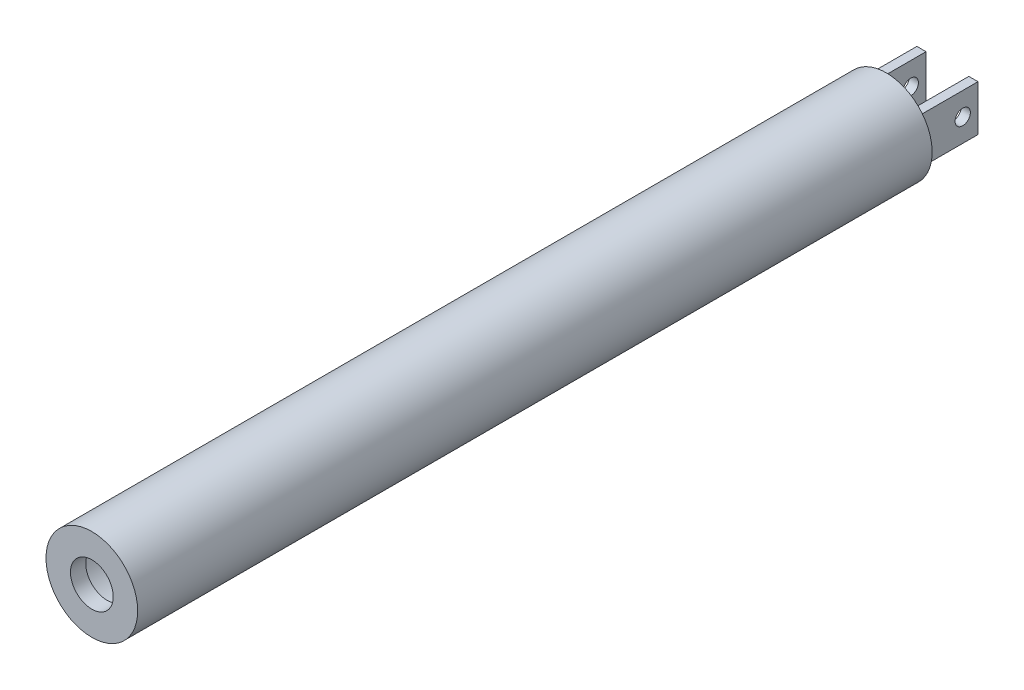
ISO-10303-21;
HEADER;
FILE_DESCRIPTION(('STEP AP214'),'2;1');
FILE_NAME('part.step','',(''),(''),'','','');
FILE_SCHEMA(('AUTOMOTIVE_DESIGN { 1 0 10303 214 1 1 1 1 }'));
ENDSEC;
DATA;
#1=APPLICATION_CONTEXT('core data for automotive mechanical design processes');
#2=APPLICATION_PROTOCOL_DEFINITION('international standard','automotive_design',2000,#1);
#3=PRODUCT_CONTEXT('',#1,'mechanical');
#4=PRODUCT('Part','Part','',(#3));
#5=PRODUCT_RELATED_PRODUCT_CATEGORY('part','',(#4));
#6=PRODUCT_DEFINITION_FORMATION('','',#4);
#7=PRODUCT_DEFINITION_CONTEXT('part definition',#1,'design');
#8=PRODUCT_DEFINITION('design','',#6,#7);
#9=PRODUCT_DEFINITION_SHAPE('','',#8);
#10=(LENGTH_UNIT() NAMED_UNIT(*) SI_UNIT(.MILLI.,.METRE.));
#11=(NAMED_UNIT(*) PLANE_ANGLE_UNIT() SI_UNIT($,.RADIAN.));
#12=(NAMED_UNIT(*) SI_UNIT($,.STERADIAN.) SOLID_ANGLE_UNIT());
#13=UNCERTAINTY_MEASURE_WITH_UNIT(LENGTH_MEASURE(1.E-05),#10,'distance_accuracy_value','');
#14=(GEOMETRIC_REPRESENTATION_CONTEXT(3) GLOBAL_UNCERTAINTY_ASSIGNED_CONTEXT((#13)) GLOBAL_UNIT_ASSIGNED_CONTEXT((#10,
#11,#12)) REPRESENTATION_CONTEXT('',''));
#15=CARTESIAN_POINT('',(0.,0.,0.));
#16=DIRECTION('',(0.,0.,1.));
#17=DIRECTION('',(1.,0.,0.));
#18=AXIS2_PLACEMENT_3D('',#15,#16,#17);
#19=CARTESIAN_POINT('',(-10.,-7.50000000000001,-25.));
#20=DIRECTION('',(0.,0.,-1.));
#21=DIRECTION('',(-1.,0.,0.));
#22=AXIS2_PLACEMENT_3D('',#19,#20,#21);
#23=PLANE('',#22);
#24=DIRECTION('',(0.,1.,0.));
#25=VECTOR('',#24,1.);
#26=CARTESIAN_POINT('',(-7.,-7.49999999999998,-25.));
#27=LINE('',#26,#25);
#28=CARTESIAN_POINT('',(-7.,-7.49999999999998,-25.));
#29=VERTEX_POINT('',#28);
#30=CARTESIAN_POINT('',(-7.,7.49999999999998,-25.));
#31=VERTEX_POINT('',#30);
#32=EDGE_CURVE('E99',#29,#31,#27,.T.);
#33=ORIENTED_EDGE('',*,*,#32,.F.);
#34=DIRECTION('',(1.,0.,0.));
#35=VECTOR('',#34,1.);
#36=CARTESIAN_POINT('',(-10.,-7.50000000000001,-25.));
#37=LINE('',#36,#35);
#38=CARTESIAN_POINT('',(-10.,-7.50000000000001,-25.));
#39=VERTEX_POINT('',#38);
#40=EDGE_CURVE('E134',#39,#29,#37,.T.);
#41=ORIENTED_EDGE('',*,*,#40,.F.);
#42=DIRECTION('',(0.,1.,0.));
#43=VECTOR('',#42,1.);
#44=CARTESIAN_POINT('',(-10.,-7.50000000000001,-25.));
#45=LINE('',#44,#43);
#46=CARTESIAN_POINT('',(-10.,7.49999999999999,-25.));
#47=VERTEX_POINT('',#46);
#48=EDGE_CURVE('E120',#39,#47,#45,.T.);
#49=ORIENTED_EDGE('',*,*,#48,.T.);
#50=DIRECTION('',(1.,0.,0.));
#51=VECTOR('',#50,1.);
#52=CARTESIAN_POINT('',(-10.,7.49999999999999,-25.));
#53=LINE('',#52,#51);
#54=EDGE_CURVE('E113',#47,#31,#53,.T.);
#55=ORIENTED_EDGE('',*,*,#54,.T.);
#56=EDGE_LOOP('',(#33,#41,#49,#55));
#57=FACE_BOUND('',#56,.T.);
#58=ADVANCED_FACE('F33',(#57),#23,.T.);
#59=CARTESIAN_POINT('',(-10.,-7.50000000000001,-25.));
#60=DIRECTION('',(0.,-1.,0.));
#61=DIRECTION('',(0.,0.,-1.));
#62=AXIS2_PLACEMENT_3D('',#59,#60,#61);
#63=PLANE('',#62);
#64=DIRECTION('',(0.,0.,-1.));
#65=VECTOR('',#64,1.);
#66=CARTESIAN_POINT('',(-7.,-7.49999999999998,15.5182845286832));
#67=LINE('',#66,#65);
#68=CARTESIAN_POINT('',(-7.,-7.49999999999998,-5.));
#69=VERTEX_POINT('',#68);
#70=EDGE_CURVE('E103',#69,#29,#67,.T.);
#71=ORIENTED_EDGE('',*,*,#70,.F.);
#72=DIRECTION('',(1.,0.,0.));
#73=VECTOR('',#72,1.);
#74=CARTESIAN_POINT('',(-10.,-7.50000000000001,-5.));
#75=LINE('',#74,#73);
#76=CARTESIAN_POINT('',(-10.,-7.50000000000001,-5.));
#77=VERTEX_POINT('',#76);
#78=EDGE_CURVE('E183',#77,#69,#75,.T.);
#79=ORIENTED_EDGE('',*,*,#78,.F.);
#80=DIRECTION('',(0.,0.,-1.));
#81=VECTOR('',#80,1.);
#82=CARTESIAN_POINT('',(-10.,-7.50000000000001,-25.));
#83=LINE('',#82,#81);
#84=EDGE_CURVE('E58',#77,#39,#83,.T.);
#85=ORIENTED_EDGE('',*,*,#84,.T.);
#86=ORIENTED_EDGE('',*,*,#40,.T.);
#87=EDGE_LOOP('',(#71,#79,#85,#86));
#88=FACE_BOUND('',#87,.T.);
#89=ADVANCED_FACE('F220',(#88),#63,.T.);
#90=CARTESIAN_POINT('',(-10.,7.49999999999999,-25.));
#91=DIRECTION('',(0.,1.,0.));
#92=DIRECTION('',(0.,0.,1.));
#93=AXIS2_PLACEMENT_3D('',#90,#91,#92);
#94=PLANE('',#93);
#95=DIRECTION('',(0.,0.,-1.));
#96=VECTOR('',#95,1.);
#97=CARTESIAN_POINT('',(-7.,7.49999999999998,15.5182845286832));
#98=LINE('',#97,#96);
#99=CARTESIAN_POINT('',(-7.,7.49999999999999,-5.));
#100=VERTEX_POINT('',#99);
#101=EDGE_CURVE('E50',#100,#31,#98,.T.);
#102=ORIENTED_EDGE('',*,*,#101,.T.);
#103=ORIENTED_EDGE('',*,*,#54,.F.);
#104=DIRECTION('',(0.,0.,1.));
#105=VECTOR('',#104,1.);
#106=CARTESIAN_POINT('',(-10.,7.49999999999999,-25.));
#107=LINE('',#106,#105);
#108=CARTESIAN_POINT('',(-10.,7.49999999999999,-5.));
#109=VERTEX_POINT('',#108);
#110=EDGE_CURVE('E176',#47,#109,#107,.T.);
#111=ORIENTED_EDGE('',*,*,#110,.T.);
#112=DIRECTION('',(1.,0.,0.));
#113=VECTOR('',#112,1.);
#114=CARTESIAN_POINT('',(-10.,7.49999999999999,-5.));
#115=LINE('',#114,#113);
#116=EDGE_CURVE('E116',#109,#100,#115,.T.);
#117=ORIENTED_EDGE('',*,*,#116,.T.);
#118=EDGE_LOOP('',(#102,#103,#111,#117));
#119=FACE_BOUND('',#118,.T.);
#120=ADVANCED_FACE('F111',(#119),#94,.T.);
#121=CARTESIAN_POINT('',(-10.,0.,-20.));
#122=DIRECTION('',(1.,0.,0.));
#123=DIRECTION('',(0.,0.,-1.));
#124=AXIS2_PLACEMENT_3D('',#121,#122,#123);
#125=CYLINDRICAL_SURFACE('',#124,2.5);
#126=CARTESIAN_POINT('',(-7.,0.,-20.));
#127=DIRECTION('',(-1.,0.,0.));
#128=DIRECTION('',(0.,0.,1.));
#129=AXIS2_PLACEMENT_3D('',#126,#127,#128);
#130=CIRCLE('',#129,2.5);
#131=CARTESIAN_POINT('',(-7.,0.,-17.5));
#132=VERTEX_POINT('',#131);
#133=EDGE_CURVE('E37',#132,#132,#130,.F.);
#134=ORIENTED_EDGE('',*,*,#133,.T.);
#135=EDGE_LOOP('',(#134));
#136=FACE_BOUND('',#135,.T.);
#137=CARTESIAN_POINT('',(-10.,0.,-20.));
#138=DIRECTION('',(1.,0.,0.));
#139=DIRECTION('',(0.,0.,-1.));
#140=AXIS2_PLACEMENT_3D('',#137,#138,#139);
#141=CIRCLE('',#140,2.5);
#142=CARTESIAN_POINT('',(-10.,0.,-22.5));
#143=VERTEX_POINT('',#142);
#144=EDGE_CURVE('E172',#143,#143,#141,.T.);
#145=ORIENTED_EDGE('',*,*,#144,.F.);
#146=EDGE_LOOP('',(#145));
#147=FACE_BOUND('',#146,.T.);
#148=ADVANCED_FACE('F247',(#136,#147),#125,.F.);
#149=CARTESIAN_POINT('',(0.,0.,-5.));
#150=DIRECTION('',(0.,0.,-1.));
#151=DIRECTION('',(-1.,0.,0.));
#152=AXIS2_PLACEMENT_3D('',#149,#150,#151);
#153=PLANE('',#152);
#154=DIRECTION('',(0.,1.,0.));
#155=VECTOR('',#154,1.);
#156=CARTESIAN_POINT('',(7.,-7.49999999999999,-5.));
#157=LINE('',#156,#155);
#158=CARTESIAN_POINT('',(7.,-7.49999999999999,-5.));
#159=VERTEX_POINT('',#158);
#160=CARTESIAN_POINT('',(7.,7.49999999999998,-5.));
#161=VERTEX_POINT('',#160);
#162=EDGE_CURVE('E148',#159,#161,#157,.T.);
#163=ORIENTED_EDGE('',*,*,#162,.F.);
#164=CARTESIAN_POINT('',(10.,-7.50000000000001,-5.));
#165=VERTEX_POINT('',#164);
#166=EDGE_CURVE('E185',#159,#165,#75,.T.);
#167=ORIENTED_EDGE('',*,*,#166,.T.);
#168=DIRECTION('',(0.,-1.,0.));
#169=VECTOR('',#168,1.);
#170=CARTESIAN_POINT('',(10.,-7.50000000000001,-5.));
#171=LINE('',#170,#169);
#172=CARTESIAN_POINT('',(10.,7.49999999999999,-5.));
#173=VERTEX_POINT('',#172);
#174=EDGE_CURVE('E166',#173,#165,#171,.T.);
#175=ORIENTED_EDGE('',*,*,#174,.F.);
#176=EDGE_CURVE('E121',#161,#173,#115,.T.);
#177=ORIENTED_EDGE('',*,*,#176,.F.);
#178=EDGE_LOOP('',(#163,#167,#175,#177));
#179=FACE_BOUND('',#178,.T.);
#180=CARTESIAN_POINT('',(0.,0.,-5.));
#181=DIRECTION('',(0.,0.,-1.));
#182=DIRECTION('',(-1.,0.,0.));
#183=AXIS2_PLACEMENT_3D('',#180,#181,#182);
#184=CIRCLE('',#183,15.);
#185=CARTESIAN_POINT('',(-15.,0.,-5.));
#186=VERTEX_POINT('',#185);
#187=EDGE_CURVE('E42',#186,#186,#184,.T.);
#188=ORIENTED_EDGE('',*,*,#187,.T.);
#189=EDGE_LOOP('',(#188));
#190=FACE_BOUND('',#189,.T.);
#191=DIRECTION('',(0.,-1.,0.));
#192=VECTOR('',#191,1.);
#193=CARTESIAN_POINT('',(-10.,-7.50000000000001,-5.));
#194=LINE('',#193,#192);
#195=EDGE_CURVE('E178',#109,#77,#194,.T.);
#196=ORIENTED_EDGE('',*,*,#195,.T.);
#197=ORIENTED_EDGE('',*,*,#78,.T.);
#198=DIRECTION('',(0.,-1.,0.));
#199=VECTOR('',#198,1.);
#200=CARTESIAN_POINT('',(-7.,-7.49999999999998,-5.));
#201=LINE('',#200,#199);
#202=EDGE_CURVE('E143',#100,#69,#201,.T.);
#203=ORIENTED_EDGE('',*,*,#202,.F.);
#204=ORIENTED_EDGE('',*,*,#116,.F.);
#205=EDGE_LOOP('',(#196,#197,#203,#204));
#206=FACE_BOUND('',#205,.T.);
#207=ADVANCED_FACE('F190',(#179,#190,#206),#153,.T.);
#208=CARTESIAN_POINT('',(0.,0.,250.));
#209=DIRECTION('',(0.,0.,-1.));
#210=DIRECTION('',(-1.,0.,0.));
#211=AXIS2_PLACEMENT_3D('',#208,#209,#210);
#212=CYLINDRICAL_SURFACE('',#211,15.);
#213=ORIENTED_EDGE('',*,*,#187,.F.);
#214=EDGE_LOOP('',(#213));
#215=FACE_BOUND('',#214,.T.);
#216=CARTESIAN_POINT('',(0.,0.,255.));
#217=DIRECTION('',(0.,0.,1.));
#218=DIRECTION('',(1.,0.,0.));
#219=AXIS2_PLACEMENT_3D('',#216,#217,#218);
#220=CIRCLE('',#219,15.);
#221=CARTESIAN_POINT('',(15.,0.,255.));
#222=VERTEX_POINT('',#221);
#223=EDGE_CURVE('E130',#222,#222,#220,.T.);
#224=ORIENTED_EDGE('',*,*,#223,.F.);
#225=EDGE_LOOP('',(#224));
#226=FACE_BOUND('',#225,.T.);
#227=ADVANCED_FACE('F35',(#215,#226),#212,.T.);
#228=CARTESIAN_POINT('',(0.,0.,250.));
#229=DIRECTION('',(0.,0.,1.));
#230=DIRECTION('',(1.,0.,0.));
#231=AXIS2_PLACEMENT_3D('',#228,#229,#230);
#232=PLANE('',#231);
#233=CARTESIAN_POINT('',(0.,0.,250.));
#234=DIRECTION('',(0.,0.,1.));
#235=DIRECTION('',(1.,0.,0.));
#236=AXIS2_PLACEMENT_3D('',#233,#234,#235);
#237=CIRCLE('',#236,7.);
#238=CARTESIAN_POINT('',(7.,0.,250.));
#239=VERTEX_POINT('',#238);
#240=EDGE_CURVE('E131',#239,#239,#237,.T.);
#241=ORIENTED_EDGE('',*,*,#240,.T.);
#242=EDGE_LOOP('',(#241));
#243=FACE_BOUND('',#242,.T.);
#244=CARTESIAN_POINT('',(0.,0.,250.));
#245=DIRECTION('',(0.,0.,1.));
#246=DIRECTION('',(1.,0.,0.));
#247=AXIS2_PLACEMENT_3D('',#244,#245,#246);
#248=CIRCLE('',#247,13.5);
#249=CARTESIAN_POINT('',(13.5,0.,250.));
#250=VERTEX_POINT('',#249);
#251=EDGE_CURVE('E137',#250,#250,#248,.T.);
#252=ORIENTED_EDGE('',*,*,#251,.F.);
#253=EDGE_LOOP('',(#252));
#254=FACE_BOUND('',#253,.T.);
#255=ADVANCED_FACE('F248',(#243,#254),#232,.F.);
#256=CARTESIAN_POINT('',(0.,0.,255.));
#257=DIRECTION('',(0.,0.,1.));
#258=DIRECTION('',(1.,0.,0.));
#259=AXIS2_PLACEMENT_3D('',#256,#257,#258);
#260=PLANE('',#259);
#261=ORIENTED_EDGE('',*,*,#223,.T.);
#262=EDGE_LOOP('',(#261));
#263=FACE_BOUND('',#262,.T.);
#264=CARTESIAN_POINT('',(0.,0.,255.));
#265=DIRECTION('',(0.,0.,1.));
#266=DIRECTION('',(1.,0.,0.));
#267=AXIS2_PLACEMENT_3D('',#264,#265,#266);
#268=CIRCLE('',#267,7.);
#269=CARTESIAN_POINT('',(7.,0.,255.));
#270=VERTEX_POINT('',#269);
#271=EDGE_CURVE('E127',#270,#270,#268,.T.);
#272=ORIENTED_EDGE('',*,*,#271,.F.);
#273=EDGE_LOOP('',(#272));
#274=FACE_BOUND('',#273,.T.);
#275=ADVANCED_FACE('F251',(#263,#274),#260,.T.);
#276=CARTESIAN_POINT('',(0.,0.,255.));
#277=DIRECTION('',(0.,0.,-1.));
#278=DIRECTION('',(-1.,0.,0.));
#279=AXIS2_PLACEMENT_3D('',#276,#277,#278);
#280=CYLINDRICAL_SURFACE('',#279,7.);
#281=ORIENTED_EDGE('',*,*,#271,.T.);
#282=EDGE_LOOP('',(#281));
#283=FACE_BOUND('',#282,.T.);
#284=ORIENTED_EDGE('',*,*,#240,.F.);
#285=EDGE_LOOP('',(#284));
#286=FACE_BOUND('',#285,.T.);
#287=ADVANCED_FACE('F240',(#283,#286),#280,.F.);
#288=CARTESIAN_POINT('',(0.,0.,0.));
#289=DIRECTION('',(0.,0.,-1.));
#290=DIRECTION('',(-1.,0.,0.));
#291=AXIS2_PLACEMENT_3D('',#288,#289,#290);
#292=PLANE('',#291);
#293=CARTESIAN_POINT('',(0.,0.,0.));
#294=DIRECTION('',(0.,0.,1.));
#295=DIRECTION('',(1.,0.,0.));
#296=AXIS2_PLACEMENT_3D('',#293,#294,#295);
#297=CIRCLE('',#296,13.5);
#298=CARTESIAN_POINT('',(13.5,0.,0.));
#299=VERTEX_POINT('',#298);
#300=EDGE_CURVE('E11',#299,#299,#297,.T.);
#301=ORIENTED_EDGE('',*,*,#300,.T.);
#302=EDGE_LOOP('',(#301));
#303=FACE_BOUND('',#302,.T.);
#304=ADVANCED_FACE('F235',(#303),#292,.F.);
#305=CARTESIAN_POINT('',(0.,0.,250.));
#306=DIRECTION('',(0.,0.,-1.));
#307=DIRECTION('',(-1.,0.,0.));
#308=AXIS2_PLACEMENT_3D('',#305,#306,#307);
#309=CYLINDRICAL_SURFACE('',#308,13.5);
#310=ORIENTED_EDGE('',*,*,#251,.T.);
#311=EDGE_LOOP('',(#310));
#312=FACE_BOUND('',#311,.T.);
#313=ORIENTED_EDGE('',*,*,#300,.F.);
#314=EDGE_LOOP('',(#313));
#315=FACE_BOUND('',#314,.T.);
#316=ADVANCED_FACE('F230',(#312,#315),#309,.F.);
#317=DIRECTION('',(0.,-1.,0.));
#318=VECTOR('',#317,1.);
#319=CARTESIAN_POINT('',(7.,-7.49999999999999,-25.));
#320=LINE('',#319,#318);
#321=CARTESIAN_POINT('',(7.,7.49999999999998,-25.));
#322=VERTEX_POINT('',#321);
#323=CARTESIAN_POINT('',(7.,-7.49999999999999,-25.));
#324=VERTEX_POINT('',#323);
#325=EDGE_CURVE('E107',#322,#324,#320,.T.);
#326=ORIENTED_EDGE('',*,*,#325,.F.);
#327=CARTESIAN_POINT('',(10.,7.49999999999999,-25.));
#328=VERTEX_POINT('',#327);
#329=EDGE_CURVE('E122',#322,#328,#53,.T.);
#330=ORIENTED_EDGE('',*,*,#329,.T.);
#331=DIRECTION('',(0.,1.,0.));
#332=VECTOR('',#331,1.);
#333=CARTESIAN_POINT('',(10.,-7.50000000000001,-25.));
#334=LINE('',#333,#332);
#335=CARTESIAN_POINT('',(10.,-7.50000000000001,-25.));
#336=VERTEX_POINT('',#335);
#337=EDGE_CURVE('E160',#336,#328,#334,.T.);
#338=ORIENTED_EDGE('',*,*,#337,.F.);
#339=EDGE_CURVE('E182',#324,#336,#37,.T.);
#340=ORIENTED_EDGE('',*,*,#339,.F.);
#341=EDGE_LOOP('',(#326,#330,#338,#340));
#342=FACE_BOUND('',#341,.T.);
#343=ADVANCED_FACE('F205',(#342),#23,.T.);
#344=DIRECTION('',(0.,0.,-1.));
#345=VECTOR('',#344,1.);
#346=CARTESIAN_POINT('',(7.,-7.49999999999999,15.5182845286832));
#347=LINE('',#346,#345);
#348=EDGE_CURVE('E154',#159,#324,#347,.T.);
#349=ORIENTED_EDGE('',*,*,#348,.T.);
#350=ORIENTED_EDGE('',*,*,#339,.T.);
#351=DIRECTION('',(0.,0.,-1.));
#352=VECTOR('',#351,1.);
#353=CARTESIAN_POINT('',(10.,-7.50000000000001,-25.));
#354=LINE('',#353,#352);
#355=EDGE_CURVE('E169',#165,#336,#354,.T.);
#356=ORIENTED_EDGE('',*,*,#355,.F.);
#357=ORIENTED_EDGE('',*,*,#166,.F.);
#358=EDGE_LOOP('',(#349,#350,#356,#357));
#359=FACE_BOUND('',#358,.T.);
#360=ADVANCED_FACE('F201',(#359),#63,.T.);
#361=DIRECTION('',(0.,0.,-1.));
#362=VECTOR('',#361,1.);
#363=CARTESIAN_POINT('',(7.,7.49999999999998,15.5182845286832));
#364=LINE('',#363,#362);
#365=EDGE_CURVE('E117',#161,#322,#364,.T.);
#366=ORIENTED_EDGE('',*,*,#365,.F.);
#367=ORIENTED_EDGE('',*,*,#176,.T.);
#368=DIRECTION('',(0.,0.,1.));
#369=VECTOR('',#368,1.);
#370=CARTESIAN_POINT('',(10.,7.49999999999999,-25.));
#371=LINE('',#370,#369);
#372=EDGE_CURVE('E163',#328,#173,#371,.T.);
#373=ORIENTED_EDGE('',*,*,#372,.F.);
#374=ORIENTED_EDGE('',*,*,#329,.F.);
#375=EDGE_LOOP('',(#366,#367,#373,#374));
#376=FACE_BOUND('',#375,.T.);
#377=ADVANCED_FACE('F209',(#376),#94,.T.);
#378=CARTESIAN_POINT('',(-10.,0.,0.));
#379=DIRECTION('',(1.,0.,0.));
#380=DIRECTION('',(0.,0.,-1.));
#381=AXIS2_PLACEMENT_3D('',#378,#379,#380);
#382=PLANE('',#381);
#383=ORIENTED_EDGE('',*,*,#144,.T.);
#384=EDGE_LOOP('',(#383));
#385=FACE_BOUND('',#384,.T.);
#386=ORIENTED_EDGE('',*,*,#48,.F.);
#387=ORIENTED_EDGE('',*,*,#84,.F.);
#388=ORIENTED_EDGE('',*,*,#195,.F.);
#389=ORIENTED_EDGE('',*,*,#110,.F.);
#390=EDGE_LOOP('',(#386,#387,#388,#389));
#391=FACE_BOUND('',#390,.T.);
#392=ADVANCED_FACE('F323',(#385,#391),#382,.F.);
#393=CARTESIAN_POINT('',(7.,0.,-20.));
#394=DIRECTION('',(1.,0.,0.));
#395=DIRECTION('',(0.,1.,0.));
#396=AXIS2_PLACEMENT_3D('',#393,#394,#395);
#397=CIRCLE('',#396,2.5);
#398=CARTESIAN_POINT('',(7.,2.49999999999998,-20.));
#399=VERTEX_POINT('',#398);
#400=EDGE_CURVE('E141',#399,#399,#397,.F.);
#401=ORIENTED_EDGE('',*,*,#400,.T.);
#402=EDGE_LOOP('',(#401));
#403=FACE_BOUND('',#402,.T.);
#404=CARTESIAN_POINT('',(10.,0.,-20.));
#405=DIRECTION('',(1.,0.,0.));
#406=DIRECTION('',(0.,0.,-1.));
#407=AXIS2_PLACEMENT_3D('',#404,#405,#406);
#408=CIRCLE('',#407,2.5);
#409=CARTESIAN_POINT('',(10.,0.,-22.5));
#410=VERTEX_POINT('',#409);
#411=EDGE_CURVE('E147',#410,#410,#408,.T.);
#412=ORIENTED_EDGE('',*,*,#411,.T.);
#413=EDGE_LOOP('',(#412));
#414=FACE_BOUND('',#413,.T.);
#415=ADVANCED_FACE('F330',(#403,#414),#125,.F.);
#416=CARTESIAN_POINT('',(10.,0.,0.));
#417=DIRECTION('',(1.,0.,0.));
#418=DIRECTION('',(0.,0.,-1.));
#419=AXIS2_PLACEMENT_3D('',#416,#417,#418);
#420=PLANE('',#419);
#421=ORIENTED_EDGE('',*,*,#337,.T.);
#422=ORIENTED_EDGE('',*,*,#372,.T.);
#423=ORIENTED_EDGE('',*,*,#174,.T.);
#424=ORIENTED_EDGE('',*,*,#355,.T.);
#425=EDGE_LOOP('',(#421,#422,#423,#424));
#426=FACE_BOUND('',#425,.T.);
#427=ORIENTED_EDGE('',*,*,#411,.F.);
#428=EDGE_LOOP('',(#427));
#429=FACE_BOUND('',#428,.T.);
#430=ADVANCED_FACE('F197',(#426,#429),#420,.T.);
#431=CARTESIAN_POINT('',(-7.,-7.49999999999998,15.5182845286832));
#432=DIRECTION('',(-1.,0.,0.));
#433=DIRECTION('',(0.,0.,1.));
#434=AXIS2_PLACEMENT_3D('',#431,#432,#433);
#435=PLANE('',#434);
#436=ORIENTED_EDGE('',*,*,#202,.T.);
#437=ORIENTED_EDGE('',*,*,#70,.T.);
#438=ORIENTED_EDGE('',*,*,#32,.T.);
#439=ORIENTED_EDGE('',*,*,#101,.F.);
#440=EDGE_LOOP('',(#436,#437,#438,#439));
#441=FACE_BOUND('',#440,.T.);
#442=ORIENTED_EDGE('',*,*,#133,.F.);
#443=EDGE_LOOP('',(#442));
#444=FACE_BOUND('',#443,.T.);
#445=ADVANCED_FACE('F100',(#441,#444),#435,.F.);
#446=CARTESIAN_POINT('',(7.,-7.49999999999999,15.5182845286832));
#447=DIRECTION('',(1.,0.,0.));
#448=DIRECTION('',(0.,1.,0.));
#449=AXIS2_PLACEMENT_3D('',#446,#447,#448);
#450=PLANE('',#449);
#451=ORIENTED_EDGE('',*,*,#162,.T.);
#452=ORIENTED_EDGE('',*,*,#365,.T.);
#453=ORIENTED_EDGE('',*,*,#325,.T.);
#454=ORIENTED_EDGE('',*,*,#348,.F.);
#455=EDGE_LOOP('',(#451,#452,#453,#454));
#456=FACE_BOUND('',#455,.T.);
#457=ORIENTED_EDGE('',*,*,#400,.F.);
#458=EDGE_LOOP('',(#457));
#459=FACE_BOUND('',#458,.T.);
#460=ADVANCED_FACE('F211',(#456,#459),#450,.F.);
#461=CLOSED_SHELL('',(#58,#89,#120,#148,#207,#227,#255,#275,#287,#304,#316,#343,#360,#377,#392,
#415,#430,#445,#460));
#462=MANIFOLD_SOLID_BREP('B2',#461);
#463=ADVANCED_BREP_SHAPE_REPRESENTATION('',(#18,#462),#14);
#464=SHAPE_DEFINITION_REPRESENTATION(#9,#463);
ENDSEC;
END-ISO-10303-21;
